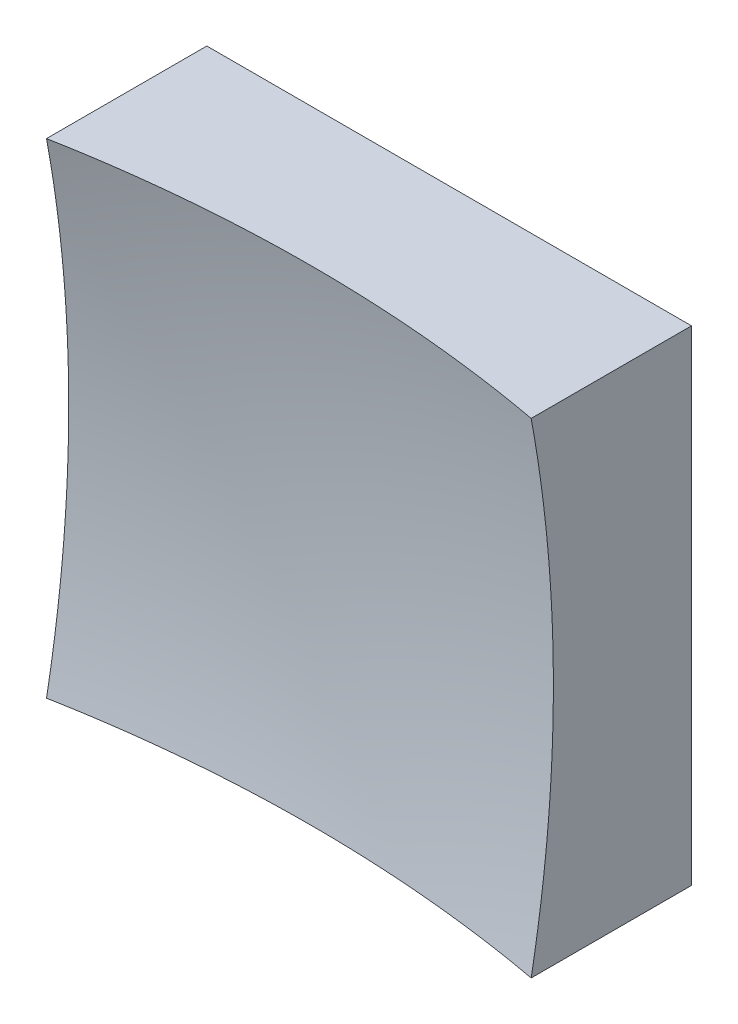
ISO-10303-21;
HEADER;
FILE_DESCRIPTION(('STEP AP214'),'2;1');
FILE_NAME('part.step','',(''),(''),'','','');
FILE_SCHEMA(('AUTOMOTIVE_DESIGN { 1 0 10303 214 1 1 1 1 }'));
ENDSEC;
DATA;
#1=APPLICATION_CONTEXT('core data for automotive mechanical design processes');
#2=APPLICATION_PROTOCOL_DEFINITION('international standard','automotive_design',2000,#1);
#3=PRODUCT_CONTEXT('',#1,'mechanical');
#4=PRODUCT('Part','Part','',(#3));
#5=PRODUCT_RELATED_PRODUCT_CATEGORY('part','',(#4));
#6=PRODUCT_DEFINITION_FORMATION('','',#4);
#7=PRODUCT_DEFINITION_CONTEXT('part definition',#1,'design');
#8=PRODUCT_DEFINITION('design','',#6,#7);
#9=PRODUCT_DEFINITION_SHAPE('','',#8);
#10=(LENGTH_UNIT() NAMED_UNIT(*) SI_UNIT(.MILLI.,.METRE.));
#11=(NAMED_UNIT(*) PLANE_ANGLE_UNIT() SI_UNIT($,.RADIAN.));
#12=(NAMED_UNIT(*) SI_UNIT($,.STERADIAN.) SOLID_ANGLE_UNIT());
#13=UNCERTAINTY_MEASURE_WITH_UNIT(LENGTH_MEASURE(1.E-05),#10,'distance_accuracy_value','');
#14=(GEOMETRIC_REPRESENTATION_CONTEXT(3) GLOBAL_UNCERTAINTY_ASSIGNED_CONTEXT((#13)) GLOBAL_UNIT_ASSIGNED_CONTEXT((#10,
#11,#12)) REPRESENTATION_CONTEXT('',''));
#15=CARTESIAN_POINT('',(0.,0.,0.));
#16=DIRECTION('',(0.,0.,1.));
#17=DIRECTION('',(1.,0.,0.));
#18=AXIS2_PLACEMENT_3D('',#15,#16,#17);
#19=CARTESIAN_POINT('',(-12.5,12.5,20.));
#20=DIRECTION('',(0.,1.,0.));
#21=DIRECTION('',(0.,0.,1.));
#22=AXIS2_PLACEMENT_3D('',#19,#20,#21);
#23=PLANE('',#22);
#24=CARTESIAN_POINT('',(0.,12.5,76.));
#25=DIRECTION('',(0.,1.,0.));
#26=DIRECTION('',(0.,0.,1.));
#27=AXIS2_PLACEMENT_3D('',#24,#25,#26);
#28=CIRCLE('',#27,68.8748865697795);
#29=CARTESIAN_POINT('',(12.5,12.5,8.26891407927968));
#30=VERTEX_POINT('',#29);
#31=CARTESIAN_POINT('',(-12.5,12.5,8.26891407927968));
#32=VERTEX_POINT('',#31);
#33=EDGE_CURVE('E79',#30,#32,#28,.T.);
#34=ORIENTED_EDGE('',*,*,#33,.F.);
#35=DIRECTION('',(0.,0.,-1.));
#36=VECTOR('',#35,1.);
#37=CARTESIAN_POINT('',(12.5,12.5,20.));
#38=LINE('',#37,#36);
#39=CARTESIAN_POINT('',(12.5,12.5,0.));
#40=VERTEX_POINT('',#39);
#41=EDGE_CURVE('E85',#30,#40,#38,.T.);
#42=ORIENTED_EDGE('',*,*,#41,.T.);
#43=DIRECTION('',(1.,0.,0.));
#44=VECTOR('',#43,1.);
#45=CARTESIAN_POINT('',(-12.5,12.5,0.));
#46=LINE('',#45,#44);
#47=CARTESIAN_POINT('',(-12.5,12.5,0.));
#48=VERTEX_POINT('',#47);
#49=EDGE_CURVE('E88',#48,#40,#46,.T.);
#50=ORIENTED_EDGE('',*,*,#49,.F.);
#51=DIRECTION('',(0.,0.,-1.));
#52=VECTOR('',#51,1.);
#53=CARTESIAN_POINT('',(-12.5,12.5,20.));
#54=LINE('',#53,#52);
#55=EDGE_CURVE('E47',#32,#48,#54,.T.);
#56=ORIENTED_EDGE('',*,*,#55,.F.);
#57=EDGE_LOOP('',(#34,#42,#50,#56));
#58=FACE_BOUND('',#57,.T.);
#59=ADVANCED_FACE('F39',(#58),#23,.T.);
#60=CARTESIAN_POINT('',(-12.5,12.5,20.));
#61=DIRECTION('',(1.,0.,0.));
#62=DIRECTION('',(0.,1.,0.));
#63=AXIS2_PLACEMENT_3D('',#60,#61,#62);
#64=PLANE('',#63);
#65=DIRECTION('',(0.,0.,-1.));
#66=VECTOR('',#65,1.);
#67=CARTESIAN_POINT('',(-12.5,-12.5,20.));
#68=LINE('',#67,#66);
#69=CARTESIAN_POINT('',(-12.5,-12.5,8.26891407927968));
#70=VERTEX_POINT('',#69);
#71=CARTESIAN_POINT('',(-12.5,-12.5,0.));
#72=VERTEX_POINT('',#71);
#73=EDGE_CURVE('E100',#70,#72,#68,.T.);
#74=ORIENTED_EDGE('',*,*,#73,.F.);
#75=CARTESIAN_POINT('',(-12.5,0.,76.));
#76=DIRECTION('',(1.,0.,0.));
#77=DIRECTION('',(0.,1.,0.));
#78=AXIS2_PLACEMENT_3D('',#75,#76,#77);
#79=CIRCLE('',#78,68.8748865697795);
#80=EDGE_CURVE('E89',#70,#32,#79,.T.);
#81=ORIENTED_EDGE('',*,*,#80,.T.);
#82=ORIENTED_EDGE('',*,*,#55,.T.);
#83=DIRECTION('',(0.,-1.,0.));
#84=VECTOR('',#83,1.);
#85=CARTESIAN_POINT('',(-12.5,12.5,0.));
#86=LINE('',#85,#84);
#87=EDGE_CURVE('E97',#48,#72,#86,.T.);
#88=ORIENTED_EDGE('',*,*,#87,.T.);
#89=EDGE_LOOP('',(#74,#81,#82,#88));
#90=FACE_BOUND('',#89,.T.);
#91=ADVANCED_FACE('F122',(#90),#64,.F.);
#92=CARTESIAN_POINT('',(-12.5,-12.5,20.));
#93=DIRECTION('',(0.,1.,0.));
#94=DIRECTION('',(0.,0.,1.));
#95=AXIS2_PLACEMENT_3D('',#92,#93,#94);
#96=PLANE('',#95);
#97=DIRECTION('',(0.,0.,-1.));
#98=VECTOR('',#97,1.);
#99=CARTESIAN_POINT('',(12.5,-12.5,20.));
#100=LINE('',#99,#98);
#101=CARTESIAN_POINT('',(12.5,-12.5,8.26891407927968));
#102=VERTEX_POINT('',#101);
#103=CARTESIAN_POINT('',(12.5,-12.5,0.));
#104=VERTEX_POINT('',#103);
#105=EDGE_CURVE('E96',#102,#104,#100,.T.);
#106=ORIENTED_EDGE('',*,*,#105,.F.);
#107=CARTESIAN_POINT('',(0.,-12.5,76.));
#108=DIRECTION('',(0.,1.,0.));
#109=DIRECTION('',(0.,0.,1.));
#110=AXIS2_PLACEMENT_3D('',#107,#108,#109);
#111=CIRCLE('',#110,68.8748865697795);
#112=EDGE_CURVE('E53',#102,#70,#111,.T.);
#113=ORIENTED_EDGE('',*,*,#112,.T.);
#114=ORIENTED_EDGE('',*,*,#73,.T.);
#115=DIRECTION('',(1.,0.,0.));
#116=VECTOR('',#115,1.);
#117=CARTESIAN_POINT('',(-12.5,-12.5,0.));
#118=LINE('',#117,#116);
#119=EDGE_CURVE('E102',#72,#104,#118,.T.);
#120=ORIENTED_EDGE('',*,*,#119,.T.);
#121=EDGE_LOOP('',(#106,#113,#114,#120));
#122=FACE_BOUND('',#121,.T.);
#123=ADVANCED_FACE('F121',(#122),#96,.F.);
#124=CARTESIAN_POINT('',(12.5,12.5,20.));
#125=DIRECTION('',(1.,0.,0.));
#126=DIRECTION('',(0.,1.,0.));
#127=AXIS2_PLACEMENT_3D('',#124,#125,#126);
#128=PLANE('',#127);
#129=CARTESIAN_POINT('',(12.5,0.,76.));
#130=DIRECTION('',(1.,0.,0.));
#131=DIRECTION('',(0.,1.,0.));
#132=AXIS2_PLACEMENT_3D('',#129,#130,#131);
#133=CIRCLE('',#132,68.8748865697795);
#134=EDGE_CURVE('E11',#102,#30,#133,.T.);
#135=ORIENTED_EDGE('',*,*,#134,.F.);
#136=ORIENTED_EDGE('',*,*,#105,.T.);
#137=DIRECTION('',(0.,-1.,0.));
#138=VECTOR('',#137,1.);
#139=CARTESIAN_POINT('',(12.5,12.5,0.));
#140=LINE('',#139,#138);
#141=EDGE_CURVE('E93',#40,#104,#140,.T.);
#142=ORIENTED_EDGE('',*,*,#141,.F.);
#143=ORIENTED_EDGE('',*,*,#41,.F.);
#144=EDGE_LOOP('',(#135,#136,#142,#143));
#145=FACE_BOUND('',#144,.T.);
#146=ADVANCED_FACE('F91',(#145),#128,.T.);
#147=CARTESIAN_POINT('',(0.,0.,0.));
#148=DIRECTION('',(0.,0.,-1.));
#149=DIRECTION('',(-1.,0.,0.));
#150=AXIS2_PLACEMENT_3D('',#147,#148,#149);
#151=PLANE('',#150);
#152=ORIENTED_EDGE('',*,*,#49,.T.);
#153=ORIENTED_EDGE('',*,*,#141,.T.);
#154=ORIENTED_EDGE('',*,*,#119,.F.);
#155=ORIENTED_EDGE('',*,*,#87,.F.);
#156=EDGE_LOOP('',(#152,#153,#154,#155));
#157=FACE_BOUND('',#156,.T.);
#158=ADVANCED_FACE('F125',(#157),#151,.T.);
#159=CARTESIAN_POINT('',(0.,0.,76.));
#160=DIRECTION('',(0.,0.,1.));
#161=DIRECTION('',(1.,0.,0.));
#162=AXIS2_PLACEMENT_3D('',#159,#160,#161);
#163=SPHERICAL_SURFACE('',#162,70.);
#164=ORIENTED_EDGE('',*,*,#33,.T.);
#165=ORIENTED_EDGE('',*,*,#80,.F.);
#166=ORIENTED_EDGE('',*,*,#112,.F.);
#167=ORIENTED_EDGE('',*,*,#134,.T.);
#168=EDGE_LOOP('',(#164,#165,#166,#167));
#169=FACE_BOUND('',#168,.T.);
#170=ADVANCED_FACE('F78',(#169),#163,.F.);
#171=CLOSED_SHELL('',(#59,#91,#123,#146,#158,#170));
#172=MANIFOLD_SOLID_BREP('B2',#171);
#173=ADVANCED_BREP_SHAPE_REPRESENTATION('',(#18,#172),#14);
#174=SHAPE_DEFINITION_REPRESENTATION(#9,#173);
ENDSEC;
END-ISO-10303-21;
